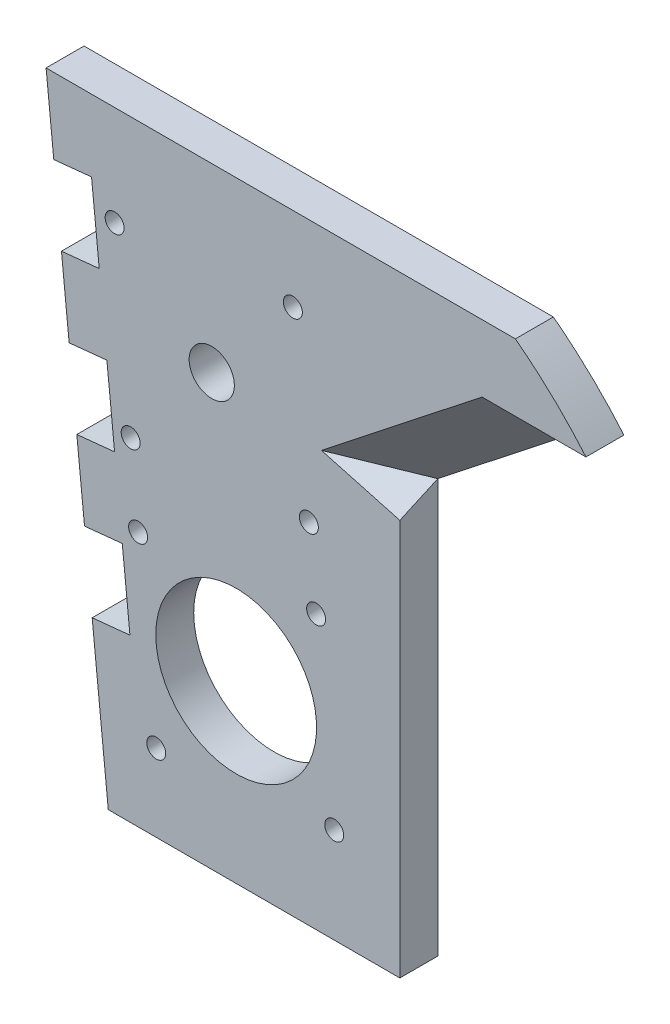
ISO-10303-21;
HEADER;
FILE_DESCRIPTION(('STEP AP214'),'2;1');
FILE_NAME('part.step','',(''),(''),'','','');
FILE_SCHEMA(('AUTOMOTIVE_DESIGN { 1 0 10303 214 1 1 1 1 }'));
ENDSEC;
DATA;
#1=APPLICATION_CONTEXT('core data for automotive mechanical design processes');
#2=APPLICATION_PROTOCOL_DEFINITION('international standard','automotive_design',2000,#1);
#3=PRODUCT_CONTEXT('',#1,'mechanical');
#4=PRODUCT('Part','Part','',(#3));
#5=PRODUCT_RELATED_PRODUCT_CATEGORY('part','',(#4));
#6=PRODUCT_DEFINITION_FORMATION('','',#4);
#7=PRODUCT_DEFINITION_CONTEXT('part definition',#1,'design');
#8=PRODUCT_DEFINITION('design','',#6,#7);
#9=PRODUCT_DEFINITION_SHAPE('','',#8);
#10=(LENGTH_UNIT() NAMED_UNIT(*) SI_UNIT(.MILLI.,.METRE.));
#11=(NAMED_UNIT(*) PLANE_ANGLE_UNIT() SI_UNIT($,.RADIAN.));
#12=(NAMED_UNIT(*) SI_UNIT($,.STERADIAN.) SOLID_ANGLE_UNIT());
#13=UNCERTAINTY_MEASURE_WITH_UNIT(LENGTH_MEASURE(1.E-05),#10,'distance_accuracy_value','');
#14=(GEOMETRIC_REPRESENTATION_CONTEXT(3) GLOBAL_UNCERTAINTY_ASSIGNED_CONTEXT((#13)) GLOBAL_UNIT_ASSIGNED_CONTEXT((#10,
#11,#12)) REPRESENTATION_CONTEXT('',''));
#15=CARTESIAN_POINT('',(0.,0.,0.));
#16=DIRECTION('',(0.,0.,1.));
#17=DIRECTION('',(1.,0.,0.));
#18=AXIS2_PLACEMENT_3D('',#15,#16,#17);
#19=CARTESIAN_POINT('',(89.7774288877045,39.3405764106255,10.));
#20=DIRECTION('',(0.,0.,1.));
#21=DIRECTION('',(1.,0.,0.));
#22=AXIS2_PLACEMENT_3D('',#19,#20,#21);
#23=PLANE('',#22);
#24=DIRECTION('',(0.,-1.,0.));
#25=VECTOR('',#24,1.);
#26=CARTESIAN_POINT('',(49.5550568212858,-113.389032165571,10.));
#27=LINE('',#26,#25);
#28=CARTESIAN_POINT('',(49.5550568212858,-8.97283052752317,10.));
#29=VERTEX_POINT('',#28);
#30=CARTESIAN_POINT('',(49.5550568212858,-113.389032165571,10.));
#31=VERTEX_POINT('',#30);
#32=EDGE_CURVE('E330',#29,#31,#27,.T.);
#33=ORIENTED_EDGE('',*,*,#32,.F.);
#34=DIRECTION('',(-0.964661368461398,0.263492778265711,0.));
#35=VECTOR('',#34,1.);
#36=CARTESIAN_POINT('',(74.7044873939802,-15.8422808341828,10.));
#37=LINE('',#36,#35);
#38=CARTESIAN_POINT('',(28.9020099924533,-3.33154658426689,10.));
#39=VERTEX_POINT('',#38);
#40=EDGE_CURVE('E342',#29,#39,#37,.T.);
#41=ORIENTED_EDGE('',*,*,#40,.T.);
#42=DIRECTION('',(-0.785571964278925,-0.618770303859963,0.));
#43=VECTOR('',#42,1.);
#44=CARTESIAN_POINT('',(87.2120827186889,42.5974619083256,10.));
#45=LINE('',#44,#43);
#46=CARTESIAN_POINT('',(71.2187281014448,30.0000000000001,10.));
#47=VERTEX_POINT('',#46);
#48=EDGE_CURVE('E346',#47,#39,#45,.T.);
#49=ORIENTED_EDGE('',*,*,#48,.F.);
#50=DIRECTION('',(1.,9.70602938485664E-11,0.));
#51=VECTOR('',#50,1.);
#52=CARTESIAN_POINT('',(95.,30.0000000023081,10.));
#53=LINE('',#52,#51);
#54=CARTESIAN_POINT('',(98.5875030935121,30.0000000026563,10.));
#55=VERTEX_POINT('',#54);
#56=EDGE_CURVE('E189',#47,#55,#53,.T.);
#57=ORIENTED_EDGE('',*,*,#56,.T.);
#58=CARTESIAN_POINT('',(98.5875030935121,30.0000000026563,10.));
#59=CARTESIAN_POINT('',(90.261106228653,39.8511854761597,10.));
#60=CARTESIAN_POINT('',(80.,47.6599346875264,10.));
#61=B_SPLINE_CURVE_WITH_KNOTS('',2,(#58,#59,#60),.UNSPECIFIED.,.F.,.F.,(3,3),(0.,1.),.UNSPECIFIED.);
#62=CARTESIAN_POINT('',(80.,47.6599346875264,10.));
#63=VERTEX_POINT('',#62);
#64=EDGE_CURVE('E52',#55,#63,#61,.T.);
#65=ORIENTED_EDGE('',*,*,#64,.T.);
#66=DIRECTION('',(-1.,0.,0.));
#67=VECTOR('',#66,1.);
#68=CARTESIAN_POINT('',(-43.6414188470975,47.6599346875264,10.));
#69=LINE('',#68,#67);
#70=CARTESIAN_POINT('',(-43.6414188470975,47.6599346875264,10.));
#71=VERTEX_POINT('',#70);
#72=EDGE_CURVE('E413',#63,#71,#69,.T.);
#73=ORIENTED_EDGE('',*,*,#72,.T.);
#74=DIRECTION('',(0.101184281533411,-0.99486770033536,0.));
#75=VECTOR('',#74,1.);
#76=CARTESIAN_POINT('',(-43.6414188470975,47.6599346875264,10.));
#77=LINE('',#76,#75);
#78=CARTESIAN_POINT('',(-41.6177332164293,27.7625806808193,10.));
#79=VERTEX_POINT('',#78);
#80=EDGE_CURVE('E121',#71,#79,#77,.T.);
#81=ORIENTED_EDGE('',*,*,#80,.T.);
#82=DIRECTION('',(0.99486770033536,0.101184281533411,0.));
#83=VECTOR('',#82,1.);
#84=CARTESIAN_POINT('',(-41.6177332164293,27.7625806808193,10.));
#85=LINE('',#84,#83);
#86=CARTESIAN_POINT('',(-31.6690562130757,28.7744234961534,10.));
#87=VERTEX_POINT('',#86);
#88=EDGE_CURVE('E416',#79,#87,#85,.T.);
#89=ORIENTED_EDGE('',*,*,#88,.T.);
#90=DIRECTION('',(0.101184281533411,-0.99486770033536,0.));
#91=VECTOR('',#90,1.);
#92=CARTESIAN_POINT('',(-31.6690562130757,28.7744234961534,10.));
#93=LINE('',#92,#91);
#94=CARTESIAN_POINT('',(-29.6453705824075,8.87706948944615,10.));
#95=VERTEX_POINT('',#94);
#96=EDGE_CURVE('E418',#87,#95,#93,.T.);
#97=ORIENTED_EDGE('',*,*,#96,.T.);
#98=DIRECTION('',(-0.99486770033536,-0.10118428153341,0.));
#99=VECTOR('',#98,1.);
#100=CARTESIAN_POINT('',(-29.6453705824075,8.87706948944615,10.));
#101=LINE('',#100,#99);
#102=CARTESIAN_POINT('',(-39.5940475857611,7.86522667411205,10.));
#103=VERTEX_POINT('',#102);
#104=EDGE_CURVE('E420',#95,#103,#101,.T.);
#105=ORIENTED_EDGE('',*,*,#104,.T.);
#106=DIRECTION('',(0.101184281533411,-0.99486770033536,0.));
#107=VECTOR('',#106,1.);
#108=CARTESIAN_POINT('',(-39.5940475857611,7.86522667411205,10.));
#109=LINE('',#108,#107);
#110=CARTESIAN_POINT('',(-37.5703619550929,-12.0321273325951,10.));
#111=VERTEX_POINT('',#110);
#112=EDGE_CURVE('E422',#103,#111,#109,.T.);
#113=ORIENTED_EDGE('',*,*,#112,.T.);
#114=DIRECTION('',(0.99486770033536,0.10118428153341,0.));
#115=VECTOR('',#114,1.);
#116=CARTESIAN_POINT('',(-37.5703619550929,-12.0321273325951,10.));
#117=LINE('',#116,#115);
#118=CARTESIAN_POINT('',(-27.6216849517393,-11.020284517261,10.));
#119=VERTEX_POINT('',#118);
#120=EDGE_CURVE('E424',#111,#119,#117,.T.);
#121=ORIENTED_EDGE('',*,*,#120,.T.);
#122=DIRECTION('',(0.101184281533411,-0.99486770033536,0.));
#123=VECTOR('',#122,1.);
#124=CARTESIAN_POINT('',(-27.6216849517393,-11.020284517261,10.));
#125=LINE('',#124,#123);
#126=CARTESIAN_POINT('',(-25.597999321071,-30.9176385239682,10.));
#127=VERTEX_POINT('',#126);
#128=EDGE_CURVE('E426',#119,#127,#125,.T.);
#129=ORIENTED_EDGE('',*,*,#128,.T.);
#130=DIRECTION('',(-0.99486770033536,-0.101184281533413,0.));
#131=VECTOR('',#130,1.);
#132=CARTESIAN_POINT('',(-25.597999321071,-30.9176385239682,10.));
#133=LINE('',#132,#131);
#134=CARTESIAN_POINT('',(-35.5466763244246,-31.9294813393023,10.));
#135=VERTEX_POINT('',#134);
#136=EDGE_CURVE('E428',#127,#135,#133,.T.);
#137=ORIENTED_EDGE('',*,*,#136,.T.);
#138=DIRECTION('',(0.101184281533411,-0.99486770033536,0.));
#139=VECTOR('',#138,1.);
#140=CARTESIAN_POINT('',(-35.5466763244246,-31.9294813393023,10.));
#141=LINE('',#140,#139);
#142=CARTESIAN_POINT('',(-33.5229906937564,-51.8268353460095,10.));
#143=VERTEX_POINT('',#142);
#144=EDGE_CURVE('E430',#135,#143,#141,.T.);
#145=ORIENTED_EDGE('',*,*,#144,.T.);
#146=DIRECTION('',(0.99486770033536,0.10118428153341,0.));
#147=VECTOR('',#146,1.);
#148=CARTESIAN_POINT('',(-33.5229906937564,-51.8268353460095,10.));
#149=LINE('',#148,#147);
#150=CARTESIAN_POINT('',(-23.5743136904028,-50.8149925306754,10.));
#151=VERTEX_POINT('',#150);
#152=EDGE_CURVE('E432',#143,#151,#149,.T.);
#153=ORIENTED_EDGE('',*,*,#152,.T.);
#154=DIRECTION('',(0.101184281533411,-0.99486770033536,0.));
#155=VECTOR('',#154,1.);
#156=CARTESIAN_POINT('',(-23.5743136904028,-50.8149925306754,10.));
#157=LINE('',#156,#155);
#158=CARTESIAN_POINT('',(-21.5506280597346,-70.7123465373826,10.));
#159=VERTEX_POINT('',#158);
#160=EDGE_CURVE('E434',#151,#159,#157,.T.);
#161=ORIENTED_EDGE('',*,*,#160,.T.);
#162=DIRECTION('',(-0.99486770033536,-0.101184281533412,0.));
#163=VECTOR('',#162,1.);
#164=CARTESIAN_POINT('',(-21.5506280597346,-70.7123465373826,10.));
#165=LINE('',#164,#163);
#166=CARTESIAN_POINT('',(-31.4993050630882,-71.7241893527168,10.));
#167=VERTEX_POINT('',#166);
#168=EDGE_CURVE('E169',#159,#167,#165,.T.);
#169=ORIENTED_EDGE('',*,*,#168,.T.);
#170=DIRECTION('',(0.10118428153341,-0.99486770033536,0.));
#171=VECTOR('',#170,1.);
#172=CARTESIAN_POINT('',(-31.4993050630882,-71.7241893527168,10.));
#173=LINE('',#172,#171);
#174=CARTESIAN_POINT('',(-27.2617293695563,-113.389032165571,10.));
#175=VERTEX_POINT('',#174);
#176=EDGE_CURVE('E161',#167,#175,#173,.T.);
#177=ORIENTED_EDGE('',*,*,#176,.T.);
#178=DIRECTION('',(1.,0.,0.));
#179=VECTOR('',#178,1.);
#180=CARTESIAN_POINT('',(-27.2617293695563,-113.389032165571,10.));
#181=LINE('',#180,#179);
#182=EDGE_CURVE('E167',#175,#31,#181,.T.);
#183=ORIENTED_EDGE('',*,*,#182,.T.);
#184=EDGE_LOOP('',(#33,#41,#49,#57,#65,#73,#81,#89,#97,#105,#113,#121,#129,#137,#145,#153,#161,
#169,#177,#183));
#185=FACE_BOUND('',#184,.T.);
#186=CARTESIAN_POINT('',(-21.3650245311093,-25.5856507985452,10.));
#187=DIRECTION('',(0.,0.,-1.));
#188=DIRECTION('',(1.,0.,0.));
#189=AXIS2_PLACEMENT_3D('',#186,#187,#188);
#190=CIRCLE('',#189,2.50000000000001);
#191=CARTESIAN_POINT('',(-18.8650245311093,-25.5856507985452,10.));
#192=VERTEX_POINT('',#191);
#193=EDGE_CURVE('E354',#192,#192,#190,.T.);
#194=ORIENTED_EDGE('',*,*,#193,.T.);
#195=EDGE_LOOP('',(#194));
#196=FACE_BOUND('',#195,.T.);
#197=CARTESIAN_POINT('',(25.5856507985453,-21.3650245311093,10.));
#198=DIRECTION('',(0.,0.,-1.));
#199=DIRECTION('',(1.,0.,0.));
#200=AXIS2_PLACEMENT_3D('',#197,#198,#199);
#201=CIRCLE('',#200,2.5);
#202=CARTESIAN_POINT('',(28.0856507985453,-21.3650245311093,10.));
#203=VERTEX_POINT('',#202);
#204=EDGE_CURVE('E360',#203,#203,#201,.T.);
#205=ORIENTED_EDGE('',*,*,#204,.T.);
#206=EDGE_LOOP('',(#205));
#207=FACE_BOUND('',#206,.T.);
#208=CARTESIAN_POINT('',(21.3650245311093,25.5856507985452,10.));
#209=DIRECTION('',(0.,0.,-1.));
#210=DIRECTION('',(1.,0.,0.));
#211=AXIS2_PLACEMENT_3D('',#208,#209,#210);
#212=CIRCLE('',#211,2.5);
#213=CARTESIAN_POINT('',(23.8650245311093,25.5856507985452,10.));
#214=VERTEX_POINT('',#213);
#215=EDGE_CURVE('E366',#214,#214,#212,.T.);
#216=ORIENTED_EDGE('',*,*,#215,.T.);
#217=EDGE_LOOP('',(#216));
#218=FACE_BOUND('',#217,.T.);
#219=CARTESIAN_POINT('',(-25.5856507985452,21.3650245311093,10.));
#220=DIRECTION('',(0.,0.,-1.));
#221=DIRECTION('',(1.,0.,0.));
#222=AXIS2_PLACEMENT_3D('',#219,#220,#221);
#223=CIRCLE('',#222,2.49999999999999);
#224=CARTESIAN_POINT('',(-23.0856507985452,21.3650245311093,10.));
#225=VERTEX_POINT('',#224);
#226=EDGE_CURVE('E372',#225,#225,#223,.T.);
#227=ORIENTED_EDGE('',*,*,#226,.T.);
#228=EDGE_LOOP('',(#227));
#229=FACE_BOUND('',#228,.T.);
#230=CARTESIAN_POINT('',(27.5009657487236,-41.3584426999135,10.));
#231=DIRECTION('',(0.,0.,-1.));
#232=DIRECTION('',(-1.,0.,0.));
#233=AXIS2_PLACEMENT_3D('',#230,#231,#232);
#234=CIRCLE('',#233,2.5);
#235=CARTESIAN_POINT('',(25.0009657487236,-41.3584426999135,10.));
#236=VERTEX_POINT('',#235);
#237=EDGE_CURVE('E378',#236,#236,#234,.T.);
#238=ORIENTED_EDGE('',*,*,#237,.T.);
#239=EDGE_LOOP('',(#238));
#240=FACE_BOUND('',#239,.T.);
#241=CARTESIAN_POINT('',(-19.3970976450852,-46.1282697313985,10.));
#242=DIRECTION('',(0.,0.,-1.));
#243=DIRECTION('',(-1.,0.,0.));
#244=AXIS2_PLACEMENT_3D('',#241,#242,#243);
#245=CIRCLE('',#244,2.5);
#246=CARTESIAN_POINT('',(-21.8970976450853,-46.1282697313985,10.));
#247=VERTEX_POINT('',#246);
#248=EDGE_CURVE('E384',#247,#247,#245,.T.);
#249=ORIENTED_EDGE('',*,*,#248,.T.);
#250=EDGE_LOOP('',(#249));
#251=FACE_BOUND('',#250,.T.);
#252=CARTESIAN_POINT('',(32.2707927802086,-88.2565060937223,10.));
#253=DIRECTION('',(0.,0.,-1.));
#254=DIRECTION('',(-1.,0.,0.));
#255=AXIS2_PLACEMENT_3D('',#252,#253,#254);
#256=CIRCLE('',#255,2.5);
#257=CARTESIAN_POINT('',(29.7707927802086,-88.2565060937223,10.));
#258=VERTEX_POINT('',#257);
#259=EDGE_CURVE('E390',#258,#258,#256,.T.);
#260=ORIENTED_EDGE('',*,*,#259,.T.);
#261=EDGE_LOOP('',(#260));
#262=FACE_BOUND('',#261,.T.);
#263=CARTESIAN_POINT('',(-14.6272706136002,-93.0263331252074,10.));
#264=DIRECTION('',(0.,0.,-1.));
#265=DIRECTION('',(-1.,0.,0.));
#266=AXIS2_PLACEMENT_3D('',#263,#264,#265);
#267=CIRCLE('',#266,2.49999999999999);
#268=CARTESIAN_POINT('',(-17.1272706136002,-93.0263331252074,10.));
#269=VERTEX_POINT('',#268);
#270=EDGE_CURVE('E396',#269,#269,#267,.T.);
#271=ORIENTED_EDGE('',*,*,#270,.T.);
#272=EDGE_LOOP('',(#271));
#273=FACE_BOUND('',#272,.T.);
#274=CARTESIAN_POINT('',(6.43684756756168,-67.1923879125604,10.));
#275=DIRECTION('',(0.,0.,-1.));
#276=DIRECTION('',(-1.,0.,0.));
#277=AXIS2_PLACEMENT_3D('',#274,#275,#276);
#278=CIRCLE('',#277,21.1868213887288);
#279=CARTESIAN_POINT('',(-14.7499738211672,-67.1923879125604,10.));
#280=VERTEX_POINT('',#279);
#281=EDGE_CURVE('E402',#280,#280,#278,.T.);
#282=ORIENTED_EDGE('',*,*,#281,.T.);
#283=EDGE_LOOP('',(#282));
#284=FACE_BOUND('',#283,.T.);
#285=CARTESIAN_POINT('',(0.,0.,10.));
#286=DIRECTION('',(0.,0.,1.));
#287=DIRECTION('',(1.,0.,0.));
#288=AXIS2_PLACEMENT_3D('',#285,#286,#287);
#289=CIRCLE('',#288,5.95852080608697);
#290=CARTESIAN_POINT('',(5.95852080608697,0.,10.));
#291=VERTEX_POINT('',#290);
#292=EDGE_CURVE('E408',#291,#291,#289,.T.);
#293=ORIENTED_EDGE('',*,*,#292,.F.);
#294=EDGE_LOOP('',(#293));
#295=FACE_BOUND('',#294,.T.);
#296=ADVANCED_FACE('F35',(#185,#196,#207,#218,#229,#240,#251,#262,#273,#284,#295),#23,.T.);
#297=CARTESIAN_POINT('',(89.7774288877045,39.3405764106255,0.));
#298=DIRECTION('',(0.,0.,1.));
#299=DIRECTION('',(1.,0.,0.));
#300=AXIS2_PLACEMENT_3D('',#297,#298,#299);
#301=PLANE('',#300);
#302=CARTESIAN_POINT('',(-21.3650245311093,-25.5856507985452,0.));
#303=DIRECTION('',(0.,0.,-1.));
#304=DIRECTION('',(1.,0.,0.));
#305=AXIS2_PLACEMENT_3D('',#302,#303,#304);
#306=CIRCLE('',#305,2.50000000000001);
#307=CARTESIAN_POINT('',(-18.8650245311093,-25.5856507985452,0.));
#308=VERTEX_POINT('',#307);
#309=EDGE_CURVE('E348',#308,#308,#306,.T.);
#310=ORIENTED_EDGE('',*,*,#309,.F.);
#311=EDGE_LOOP('',(#310));
#312=FACE_BOUND('',#311,.T.);
#313=CARTESIAN_POINT('',(25.5856507985453,-21.3650245311093,0.));
#314=DIRECTION('',(0.,0.,-1.));
#315=DIRECTION('',(1.,0.,0.));
#316=AXIS2_PLACEMENT_3D('',#313,#314,#315);
#317=CIRCLE('',#316,2.5);
#318=CARTESIAN_POINT('',(28.0856507985453,-21.3650245311093,0.));
#319=VERTEX_POINT('',#318);
#320=EDGE_CURVE('E357',#319,#319,#317,.T.);
#321=ORIENTED_EDGE('',*,*,#320,.F.);
#322=EDGE_LOOP('',(#321));
#323=FACE_BOUND('',#322,.T.);
#324=CARTESIAN_POINT('',(21.3650245311093,25.5856507985452,0.));
#325=DIRECTION('',(0.,0.,-1.));
#326=DIRECTION('',(1.,0.,0.));
#327=AXIS2_PLACEMENT_3D('',#324,#325,#326);
#328=CIRCLE('',#327,2.5);
#329=CARTESIAN_POINT('',(23.8650245311093,25.5856507985452,0.));
#330=VERTEX_POINT('',#329);
#331=EDGE_CURVE('E363',#330,#330,#328,.T.);
#332=ORIENTED_EDGE('',*,*,#331,.F.);
#333=EDGE_LOOP('',(#332));
#334=FACE_BOUND('',#333,.T.);
#335=CARTESIAN_POINT('',(-25.5856507985452,21.3650245311093,0.));
#336=DIRECTION('',(0.,0.,-1.));
#337=DIRECTION('',(1.,0.,0.));
#338=AXIS2_PLACEMENT_3D('',#335,#336,#337);
#339=CIRCLE('',#338,2.49999999999999);
#340=CARTESIAN_POINT('',(-23.0856507985452,21.3650245311093,0.));
#341=VERTEX_POINT('',#340);
#342=EDGE_CURVE('E369',#341,#341,#339,.T.);
#343=ORIENTED_EDGE('',*,*,#342,.F.);
#344=EDGE_LOOP('',(#343));
#345=FACE_BOUND('',#344,.T.);
#346=CARTESIAN_POINT('',(27.5009657487236,-41.3584426999135,0.));
#347=DIRECTION('',(0.,0.,-1.));
#348=DIRECTION('',(-1.,0.,0.));
#349=AXIS2_PLACEMENT_3D('',#346,#347,#348);
#350=CIRCLE('',#349,2.5);
#351=CARTESIAN_POINT('',(25.0009657487236,-41.3584426999135,0.));
#352=VERTEX_POINT('',#351);
#353=EDGE_CURVE('E375',#352,#352,#350,.T.);
#354=ORIENTED_EDGE('',*,*,#353,.F.);
#355=EDGE_LOOP('',(#354));
#356=FACE_BOUND('',#355,.T.);
#357=CARTESIAN_POINT('',(-19.3970976450852,-46.1282697313985,0.));
#358=DIRECTION('',(0.,0.,-1.));
#359=DIRECTION('',(-1.,0.,0.));
#360=AXIS2_PLACEMENT_3D('',#357,#358,#359);
#361=CIRCLE('',#360,2.5);
#362=CARTESIAN_POINT('',(-21.8970976450853,-46.1282697313985,0.));
#363=VERTEX_POINT('',#362);
#364=EDGE_CURVE('E381',#363,#363,#361,.T.);
#365=ORIENTED_EDGE('',*,*,#364,.F.);
#366=EDGE_LOOP('',(#365));
#367=FACE_BOUND('',#366,.T.);
#368=CARTESIAN_POINT('',(32.2707927802086,-88.2565060937223,0.));
#369=DIRECTION('',(0.,0.,-1.));
#370=DIRECTION('',(-1.,0.,0.));
#371=AXIS2_PLACEMENT_3D('',#368,#369,#370);
#372=CIRCLE('',#371,2.5);
#373=CARTESIAN_POINT('',(29.7707927802086,-88.2565060937223,0.));
#374=VERTEX_POINT('',#373);
#375=EDGE_CURVE('E387',#374,#374,#372,.T.);
#376=ORIENTED_EDGE('',*,*,#375,.F.);
#377=EDGE_LOOP('',(#376));
#378=FACE_BOUND('',#377,.T.);
#379=CARTESIAN_POINT('',(-14.6272706136002,-93.0263331252074,0.));
#380=DIRECTION('',(0.,0.,-1.));
#381=DIRECTION('',(-1.,0.,0.));
#382=AXIS2_PLACEMENT_3D('',#379,#380,#381);
#383=CIRCLE('',#382,2.49999999999999);
#384=CARTESIAN_POINT('',(-17.1272706136002,-93.0263331252074,0.));
#385=VERTEX_POINT('',#384);
#386=EDGE_CURVE('E393',#385,#385,#383,.T.);
#387=ORIENTED_EDGE('',*,*,#386,.F.);
#388=EDGE_LOOP('',(#387));
#389=FACE_BOUND('',#388,.T.);
#390=CARTESIAN_POINT('',(6.43684756756168,-67.1923879125604,0.));
#391=DIRECTION('',(0.,0.,-1.));
#392=DIRECTION('',(-1.,0.,0.));
#393=AXIS2_PLACEMENT_3D('',#390,#391,#392);
#394=CIRCLE('',#393,21.1868213887288);
#395=CARTESIAN_POINT('',(-14.7499738211672,-67.1923879125604,0.));
#396=VERTEX_POINT('',#395);
#397=EDGE_CURVE('E399',#396,#396,#394,.T.);
#398=ORIENTED_EDGE('',*,*,#397,.F.);
#399=EDGE_LOOP('',(#398));
#400=FACE_BOUND('',#399,.T.);
#401=CARTESIAN_POINT('',(0.,0.,0.));
#402=DIRECTION('',(0.,0.,1.));
#403=DIRECTION('',(1.,0.,0.));
#404=AXIS2_PLACEMENT_3D('',#401,#402,#403);
#405=CIRCLE('',#404,5.95852080608697);
#406=CARTESIAN_POINT('',(5.95852080608697,0.,0.));
#407=VERTEX_POINT('',#406);
#408=EDGE_CURVE('E405',#407,#407,#405,.T.);
#409=ORIENTED_EDGE('',*,*,#408,.T.);
#410=EDGE_LOOP('',(#409));
#411=FACE_BOUND('',#410,.T.);
#412=DIRECTION('',(-0.785571964278925,-0.618770303859963,0.));
#413=VECTOR('',#412,1.);
#414=CARTESIAN_POINT('',(95.6689711951573,31.8608534274335,0.));
#415=LINE('',#414,#413);
#416=CARTESIAN_POINT('',(93.3064882564435,30.0000000021437,-5.27355936696949E-13));
#417=VERTEX_POINT('',#416);
#418=CARTESIAN_POINT('',(49.5550568212858,-4.46162510638734,0.));
#419=VERTEX_POINT('',#418);
#420=EDGE_CURVE('E44',#417,#419,#415,.T.);
#421=ORIENTED_EDGE('',*,*,#420,.T.);
#422=DIRECTION('',(0.,-1.,0.));
#423=VECTOR('',#422,1.);
#424=CARTESIAN_POINT('',(49.5550568212858,39.3405764106255,0.));
#425=LINE('',#424,#423);
#426=CARTESIAN_POINT('',(49.5550568212858,-113.389032165571,0.));
#427=VERTEX_POINT('',#426);
#428=EDGE_CURVE('E333',#419,#427,#425,.T.);
#429=ORIENTED_EDGE('',*,*,#428,.T.);
#430=DIRECTION('',(1.,0.,0.));
#431=VECTOR('',#430,1.);
#432=CARTESIAN_POINT('',(-27.2617293695563,-113.389032165571,0.));
#433=LINE('',#432,#431);
#434=CARTESIAN_POINT('',(-27.2617293695563,-113.389032165571,0.));
#435=VERTEX_POINT('',#434);
#436=EDGE_CURVE('E536',#435,#427,#433,.T.);
#437=ORIENTED_EDGE('',*,*,#436,.F.);
#438=DIRECTION('',(0.10118428153341,-0.99486770033536,0.));
#439=VECTOR('',#438,1.);
#440=CARTESIAN_POINT('',(-31.4993050630882,-71.7241893527168,0.));
#441=LINE('',#440,#439);
#442=CARTESIAN_POINT('',(-31.4993050630882,-71.7241893527168,0.));
#443=VERTEX_POINT('',#442);
#444=EDGE_CURVE('E178',#443,#435,#441,.T.);
#445=ORIENTED_EDGE('',*,*,#444,.F.);
#446=DIRECTION('',(-0.99486770033536,-0.101184281533412,0.));
#447=VECTOR('',#446,1.);
#448=CARTESIAN_POINT('',(-21.5506280597346,-70.7123465373826,0.));
#449=LINE('',#448,#447);
#450=CARTESIAN_POINT('',(-21.5506280597346,-70.7123465373826,0.));
#451=VERTEX_POINT('',#450);
#452=EDGE_CURVE('E447',#451,#443,#449,.T.);
#453=ORIENTED_EDGE('',*,*,#452,.F.);
#454=DIRECTION('',(0.101184281533411,-0.99486770033536,0.));
#455=VECTOR('',#454,1.);
#456=CARTESIAN_POINT('',(-23.5743136904028,-50.8149925306754,0.));
#457=LINE('',#456,#455);
#458=CARTESIAN_POINT('',(-23.5743136904028,-50.8149925306754,0.));
#459=VERTEX_POINT('',#458);
#460=EDGE_CURVE('E443',#459,#451,#457,.T.);
#461=ORIENTED_EDGE('',*,*,#460,.F.);
#462=DIRECTION('',(0.99486770033536,0.10118428153341,0.));
#463=VECTOR('',#462,1.);
#464=CARTESIAN_POINT('',(-33.5229906937564,-51.8268353460095,0.));
#465=LINE('',#464,#463);
#466=CARTESIAN_POINT('',(-33.5229906937564,-51.8268353460095,0.));
#467=VERTEX_POINT('',#466);
#468=EDGE_CURVE('E529',#467,#459,#465,.T.);
#469=ORIENTED_EDGE('',*,*,#468,.F.);
#470=DIRECTION('',(0.101184281533411,-0.99486770033536,0.));
#471=VECTOR('',#470,1.);
#472=CARTESIAN_POINT('',(-35.5466763244246,-31.9294813393023,0.));
#473=LINE('',#472,#471);
#474=CARTESIAN_POINT('',(-35.5466763244246,-31.9294813393023,0.));
#475=VERTEX_POINT('',#474);
#476=EDGE_CURVE('E527',#475,#467,#473,.T.);
#477=ORIENTED_EDGE('',*,*,#476,.F.);
#478=DIRECTION('',(-0.99486770033536,-0.101184281533413,0.));
#479=VECTOR('',#478,1.);
#480=CARTESIAN_POINT('',(-25.597999321071,-30.9176385239682,0.));
#481=LINE('',#480,#479);
#482=CARTESIAN_POINT('',(-25.597999321071,-30.9176385239682,0.));
#483=VERTEX_POINT('',#482);
#484=EDGE_CURVE('E524',#483,#475,#481,.T.);
#485=ORIENTED_EDGE('',*,*,#484,.F.);
#486=DIRECTION('',(0.101184281533411,-0.99486770033536,0.));
#487=VECTOR('',#486,1.);
#488=CARTESIAN_POINT('',(-27.6216849517393,-11.020284517261,0.));
#489=LINE('',#488,#487);
#490=CARTESIAN_POINT('',(-27.6216849517393,-11.020284517261,0.));
#491=VERTEX_POINT('',#490);
#492=EDGE_CURVE('E521',#491,#483,#489,.T.);
#493=ORIENTED_EDGE('',*,*,#492,.F.);
#494=DIRECTION('',(0.99486770033536,0.10118428153341,0.));
#495=VECTOR('',#494,1.);
#496=CARTESIAN_POINT('',(-37.5703619550929,-12.0321273325951,0.));
#497=LINE('',#496,#495);
#498=CARTESIAN_POINT('',(-37.5703619550929,-12.0321273325951,0.));
#499=VERTEX_POINT('',#498);
#500=EDGE_CURVE('E547',#499,#491,#497,.T.);
#501=ORIENTED_EDGE('',*,*,#500,.F.);
#502=DIRECTION('',(0.101184281533411,-0.99486770033536,0.));
#503=VECTOR('',#502,1.);
#504=CARTESIAN_POINT('',(-39.5940475857611,7.86522667411205,0.));
#505=LINE('',#504,#503);
#506=CARTESIAN_POINT('',(-39.5940475857611,7.86522667411205,0.));
#507=VERTEX_POINT('',#506);
#508=EDGE_CURVE('E513',#507,#499,#505,.T.);
#509=ORIENTED_EDGE('',*,*,#508,.F.);
#510=DIRECTION('',(-0.99486770033536,-0.10118428153341,0.));
#511=VECTOR('',#510,1.);
#512=CARTESIAN_POINT('',(-29.6453705824075,8.87706948944615,0.));
#513=LINE('',#512,#511);
#514=CARTESIAN_POINT('',(-29.6453705824075,8.87706948944615,0.));
#515=VERTEX_POINT('',#514);
#516=EDGE_CURVE('E510',#515,#507,#513,.T.);
#517=ORIENTED_EDGE('',*,*,#516,.F.);
#518=DIRECTION('',(0.101184281533411,-0.99486770033536,0.));
#519=VECTOR('',#518,1.);
#520=CARTESIAN_POINT('',(-31.6690562130757,28.7744234961534,0.));
#521=LINE('',#520,#519);
#522=CARTESIAN_POINT('',(-31.6690562130757,28.7744234961534,0.));
#523=VERTEX_POINT('',#522);
#524=EDGE_CURVE('E551',#523,#515,#521,.T.);
#525=ORIENTED_EDGE('',*,*,#524,.F.);
#526=DIRECTION('',(0.99486770033536,0.101184281533411,0.));
#527=VECTOR('',#526,1.);
#528=CARTESIAN_POINT('',(-41.6177332164293,27.7625806808193,0.));
#529=LINE('',#528,#527);
#530=CARTESIAN_POINT('',(-41.6177332164293,27.7625806808193,0.));
#531=VERTEX_POINT('',#530);
#532=EDGE_CURVE('E502',#531,#523,#529,.T.);
#533=ORIENTED_EDGE('',*,*,#532,.F.);
#534=DIRECTION('',(0.101184281533411,-0.99486770033536,0.));
#535=VECTOR('',#534,1.);
#536=CARTESIAN_POINT('',(-43.6414188470975,47.6599346875264,0.));
#537=LINE('',#536,#535);
#538=CARTESIAN_POINT('',(-43.6414188470975,47.6599346875264,0.));
#539=VERTEX_POINT('',#538);
#540=EDGE_CURVE('E499',#539,#531,#537,.T.);
#541=ORIENTED_EDGE('',*,*,#540,.F.);
#542=DIRECTION('',(-1.,0.,0.));
#543=VECTOR('',#542,1.);
#544=CARTESIAN_POINT('',(-43.6414188470975,47.6599346875264,0.));
#545=LINE('',#544,#543);
#546=CARTESIAN_POINT('',(80.,47.6599346875264,0.));
#547=VERTEX_POINT('',#546);
#548=EDGE_CURVE('E199',#547,#539,#545,.T.);
#549=ORIENTED_EDGE('',*,*,#548,.F.);
#550=CARTESIAN_POINT('',(98.5875030935121,30.0000000026563,0.));
#551=CARTESIAN_POINT('',(90.261106228653,39.8511854761597,0.));
#552=CARTESIAN_POINT('',(80.,47.6599346875264,0.));
#553=B_SPLINE_CURVE_WITH_KNOTS('',2,(#550,#551,#552),.UNSPECIFIED.,.F.,.F.,(3,3),(0.,1.),.UNSPECIFIED.);
#554=CARTESIAN_POINT('',(98.5875030935121,30.0000000026563,0.));
#555=VERTEX_POINT('',#554);
#556=EDGE_CURVE('E112',#555,#547,#553,.T.);
#557=ORIENTED_EDGE('',*,*,#556,.F.);
#558=DIRECTION('',(1.,9.70602938485664E-11,0.));
#559=VECTOR('',#558,1.);
#560=CARTESIAN_POINT('',(95.,30.0000000023081,0.));
#561=LINE('',#560,#559);
#562=EDGE_CURVE('E106',#417,#555,#561,.T.);
#563=ORIENTED_EDGE('',*,*,#562,.F.);
#564=EDGE_LOOP('',(#421,#429,#437,#445,#453,#461,#469,#477,#485,#493,#501,#509,#517,#525,#533,
#541,#549,#557,#563));
#565=FACE_BOUND('',#564,.T.);
#566=ADVANCED_FACE('F211',(#312,#323,#334,#345,#356,#367,#378,#389,#400,#411,#565),#301,.F.);
#567=CARTESIAN_POINT('',(-43.6414188470975,47.6599346875264,10.));
#568=DIRECTION('',(0.,-1.,0.));
#569=DIRECTION('',(0.,0.,-1.));
#570=AXIS2_PLACEMENT_3D('',#567,#568,#569);
#571=PLANE('',#570);
#572=ORIENTED_EDGE('',*,*,#548,.T.);
#573=DIRECTION('',(0.,0.,-1.));
#574=VECTOR('',#573,1.);
#575=CARTESIAN_POINT('',(-43.6414188470975,47.6599346875264,10.));
#576=LINE('',#575,#574);
#577=EDGE_CURVE('E479',#71,#539,#576,.T.);
#578=ORIENTED_EDGE('',*,*,#577,.F.);
#579=ORIENTED_EDGE('',*,*,#72,.F.);
#580=DIRECTION('',(0.,0.,-1.));
#581=VECTOR('',#580,1.);
#582=CARTESIAN_POINT('',(80.,47.6599346875264,10.));
#583=LINE('',#582,#581);
#584=EDGE_CURVE('E198',#63,#547,#583,.T.);
#585=ORIENTED_EDGE('',*,*,#584,.T.);
#586=EDGE_LOOP('',(#572,#578,#579,#585));
#587=FACE_BOUND('',#586,.T.);
#588=ADVANCED_FACE('F37',(#587),#571,.F.);
#589=CARTESIAN_POINT('',(-43.6414188470975,47.6599346875264,10.));
#590=DIRECTION('',(0.99486770033536,0.101184281533411,0.));
#591=DIRECTION('',(-0.101184281533411,0.99486770033536,0.));
#592=AXIS2_PLACEMENT_3D('',#589,#590,#591);
#593=PLANE('',#592);
#594=ORIENTED_EDGE('',*,*,#540,.T.);
#595=DIRECTION('',(0.,0.,-1.));
#596=VECTOR('',#595,1.);
#597=CARTESIAN_POINT('',(-41.6177332164293,27.7625806808193,10.));
#598=LINE('',#597,#596);
#599=EDGE_CURVE('E476',#79,#531,#598,.T.);
#600=ORIENTED_EDGE('',*,*,#599,.F.);
#601=ORIENTED_EDGE('',*,*,#80,.F.);
#602=ORIENTED_EDGE('',*,*,#577,.T.);
#603=EDGE_LOOP('',(#594,#600,#601,#602));
#604=FACE_BOUND('',#603,.T.);
#605=ADVANCED_FACE('F261',(#604),#593,.F.);
#606=CARTESIAN_POINT('',(-41.6177332164293,27.7625806808193,10.));
#607=DIRECTION('',(-0.101184281533411,0.99486770033536,0.));
#608=DIRECTION('',(-0.99486770033536,-0.101184281533411,0.));
#609=AXIS2_PLACEMENT_3D('',#606,#607,#608);
#610=PLANE('',#609);
#611=ORIENTED_EDGE('',*,*,#532,.T.);
#612=DIRECTION('',(0.,0.,-1.));
#613=VECTOR('',#612,1.);
#614=CARTESIAN_POINT('',(-31.6690562130757,28.7744234961534,10.));
#615=LINE('',#614,#613);
#616=EDGE_CURVE('E473',#87,#523,#615,.T.);
#617=ORIENTED_EDGE('',*,*,#616,.F.);
#618=ORIENTED_EDGE('',*,*,#88,.F.);
#619=ORIENTED_EDGE('',*,*,#599,.T.);
#620=EDGE_LOOP('',(#611,#617,#618,#619));
#621=FACE_BOUND('',#620,.T.);
#622=ADVANCED_FACE('F258',(#621),#610,.F.);
#623=CARTESIAN_POINT('',(-31.6690562130757,28.7744234961534,10.));
#624=DIRECTION('',(0.99486770033536,0.101184281533411,0.));
#625=DIRECTION('',(-0.101184281533411,0.99486770033536,0.));
#626=AXIS2_PLACEMENT_3D('',#623,#624,#625);
#627=PLANE('',#626);
#628=ORIENTED_EDGE('',*,*,#524,.T.);
#629=DIRECTION('',(0.,0.,-1.));
#630=VECTOR('',#629,1.);
#631=CARTESIAN_POINT('',(-29.6453705824075,8.87706948944615,10.));
#632=LINE('',#631,#630);
#633=EDGE_CURVE('E470',#95,#515,#632,.T.);
#634=ORIENTED_EDGE('',*,*,#633,.F.);
#635=ORIENTED_EDGE('',*,*,#96,.F.);
#636=ORIENTED_EDGE('',*,*,#616,.T.);
#637=EDGE_LOOP('',(#628,#634,#635,#636));
#638=FACE_BOUND('',#637,.T.);
#639=ADVANCED_FACE('F254',(#638),#627,.F.);
#640=CARTESIAN_POINT('',(-29.6453705824075,8.87706948944615,10.));
#641=DIRECTION('',(0.10118428153341,-0.99486770033536,0.));
#642=DIRECTION('',(0.99486770033536,0.10118428153341,0.));
#643=AXIS2_PLACEMENT_3D('',#640,#641,#642);
#644=PLANE('',#643);
#645=ORIENTED_EDGE('',*,*,#516,.T.);
#646=DIRECTION('',(0.,0.,-1.));
#647=VECTOR('',#646,1.);
#648=CARTESIAN_POINT('',(-39.5940475857611,7.86522667411205,10.));
#649=LINE('',#648,#647);
#650=EDGE_CURVE('E467',#103,#507,#649,.T.);
#651=ORIENTED_EDGE('',*,*,#650,.F.);
#652=ORIENTED_EDGE('',*,*,#104,.F.);
#653=ORIENTED_EDGE('',*,*,#633,.T.);
#654=EDGE_LOOP('',(#645,#651,#652,#653));
#655=FACE_BOUND('',#654,.T.);
#656=ADVANCED_FACE('F250',(#655),#644,.F.);
#657=CARTESIAN_POINT('',(-39.5940475857611,7.86522667411205,10.));
#658=DIRECTION('',(0.99486770033536,0.101184281533411,0.));
#659=DIRECTION('',(-0.101184281533411,0.99486770033536,0.));
#660=AXIS2_PLACEMENT_3D('',#657,#658,#659);
#661=PLANE('',#660);
#662=ORIENTED_EDGE('',*,*,#508,.T.);
#663=DIRECTION('',(0.,0.,-1.));
#664=VECTOR('',#663,1.);
#665=CARTESIAN_POINT('',(-37.5703619550929,-12.0321273325951,10.));
#666=LINE('',#665,#664);
#667=EDGE_CURVE('E464',#111,#499,#666,.T.);
#668=ORIENTED_EDGE('',*,*,#667,.F.);
#669=ORIENTED_EDGE('',*,*,#112,.F.);
#670=ORIENTED_EDGE('',*,*,#650,.T.);
#671=EDGE_LOOP('',(#662,#668,#669,#670));
#672=FACE_BOUND('',#671,.T.);
#673=ADVANCED_FACE('F246',(#672),#661,.F.);
#674=CARTESIAN_POINT('',(-37.5703619550929,-12.0321273325951,10.));
#675=DIRECTION('',(-0.10118428153341,0.99486770033536,0.));
#676=DIRECTION('',(-0.99486770033536,-0.10118428153341,0.));
#677=AXIS2_PLACEMENT_3D('',#674,#675,#676);
#678=PLANE('',#677);
#679=ORIENTED_EDGE('',*,*,#500,.T.);
#680=DIRECTION('',(0.,0.,-1.));
#681=VECTOR('',#680,1.);
#682=CARTESIAN_POINT('',(-27.6216849517393,-11.020284517261,10.));
#683=LINE('',#682,#681);
#684=EDGE_CURVE('E461',#119,#491,#683,.T.);
#685=ORIENTED_EDGE('',*,*,#684,.F.);
#686=ORIENTED_EDGE('',*,*,#120,.F.);
#687=ORIENTED_EDGE('',*,*,#667,.T.);
#688=EDGE_LOOP('',(#679,#685,#686,#687));
#689=FACE_BOUND('',#688,.T.);
#690=ADVANCED_FACE('F242',(#689),#678,.F.);
#691=CARTESIAN_POINT('',(-27.6216849517393,-11.020284517261,10.));
#692=DIRECTION('',(0.99486770033536,0.101184281533411,0.));
#693=DIRECTION('',(-0.101184281533411,0.99486770033536,0.));
#694=AXIS2_PLACEMENT_3D('',#691,#692,#693);
#695=PLANE('',#694);
#696=ORIENTED_EDGE('',*,*,#492,.T.);
#697=DIRECTION('',(0.,0.,-1.));
#698=VECTOR('',#697,1.);
#699=CARTESIAN_POINT('',(-25.597999321071,-30.9176385239682,10.));
#700=LINE('',#699,#698);
#701=EDGE_CURVE('E458',#127,#483,#700,.T.);
#702=ORIENTED_EDGE('',*,*,#701,.F.);
#703=ORIENTED_EDGE('',*,*,#128,.F.);
#704=ORIENTED_EDGE('',*,*,#684,.T.);
#705=EDGE_LOOP('',(#696,#702,#703,#704));
#706=FACE_BOUND('',#705,.T.);
#707=ADVANCED_FACE('F238',(#706),#695,.F.);
#708=CARTESIAN_POINT('',(-25.597999321071,-30.9176385239682,10.));
#709=DIRECTION('',(0.101184281533413,-0.99486770033536,0.));
#710=DIRECTION('',(0.99486770033536,0.101184281533413,0.));
#711=AXIS2_PLACEMENT_3D('',#708,#709,#710);
#712=PLANE('',#711);
#713=ORIENTED_EDGE('',*,*,#484,.T.);
#714=DIRECTION('',(0.,0.,-1.));
#715=VECTOR('',#714,1.);
#716=CARTESIAN_POINT('',(-35.5466763244246,-31.9294813393023,10.));
#717=LINE('',#716,#715);
#718=EDGE_CURVE('E455',#135,#475,#717,.T.);
#719=ORIENTED_EDGE('',*,*,#718,.F.);
#720=ORIENTED_EDGE('',*,*,#136,.F.);
#721=ORIENTED_EDGE('',*,*,#701,.T.);
#722=EDGE_LOOP('',(#713,#719,#720,#721));
#723=FACE_BOUND('',#722,.T.);
#724=ADVANCED_FACE('F234',(#723),#712,.F.);
#725=CARTESIAN_POINT('',(-35.5466763244246,-31.9294813393023,10.));
#726=DIRECTION('',(0.99486770033536,0.101184281533411,0.));
#727=DIRECTION('',(-0.101184281533411,0.99486770033536,0.));
#728=AXIS2_PLACEMENT_3D('',#725,#726,#727);
#729=PLANE('',#728);
#730=ORIENTED_EDGE('',*,*,#476,.T.);
#731=DIRECTION('',(0.,0.,-1.));
#732=VECTOR('',#731,1.);
#733=CARTESIAN_POINT('',(-33.5229906937564,-51.8268353460095,10.));
#734=LINE('',#733,#732);
#735=EDGE_CURVE('E452',#143,#467,#734,.T.);
#736=ORIENTED_EDGE('',*,*,#735,.F.);
#737=ORIENTED_EDGE('',*,*,#144,.F.);
#738=ORIENTED_EDGE('',*,*,#718,.T.);
#739=EDGE_LOOP('',(#730,#736,#737,#738));
#740=FACE_BOUND('',#739,.T.);
#741=ADVANCED_FACE('F230',(#740),#729,.F.);
#742=CARTESIAN_POINT('',(-33.5229906937564,-51.8268353460095,10.));
#743=DIRECTION('',(-0.10118428153341,0.99486770033536,0.));
#744=DIRECTION('',(-0.99486770033536,-0.10118428153341,0.));
#745=AXIS2_PLACEMENT_3D('',#742,#743,#744);
#746=PLANE('',#745);
#747=ORIENTED_EDGE('',*,*,#468,.T.);
#748=DIRECTION('',(0.,0.,-1.));
#749=VECTOR('',#748,1.);
#750=CARTESIAN_POINT('',(-23.5743136904028,-50.8149925306754,10.));
#751=LINE('',#750,#749);
#752=EDGE_CURVE('E445',#151,#459,#751,.T.);
#753=ORIENTED_EDGE('',*,*,#752,.F.);
#754=ORIENTED_EDGE('',*,*,#152,.F.);
#755=ORIENTED_EDGE('',*,*,#735,.T.);
#756=EDGE_LOOP('',(#747,#753,#754,#755));
#757=FACE_BOUND('',#756,.T.);
#758=ADVANCED_FACE('F226',(#757),#746,.F.);
#759=CARTESIAN_POINT('',(-23.5743136904028,-50.8149925306754,10.));
#760=DIRECTION('',(0.99486770033536,0.101184281533411,0.));
#761=DIRECTION('',(-0.101184281533411,0.99486770033536,0.));
#762=AXIS2_PLACEMENT_3D('',#759,#760,#761);
#763=PLANE('',#762);
#764=ORIENTED_EDGE('',*,*,#460,.T.);
#765=DIRECTION('',(0.,0.,-1.));
#766=VECTOR('',#765,1.);
#767=CARTESIAN_POINT('',(-21.5506280597346,-70.7123465373826,10.));
#768=LINE('',#767,#766);
#769=EDGE_CURVE('E441',#159,#451,#768,.T.);
#770=ORIENTED_EDGE('',*,*,#769,.F.);
#771=ORIENTED_EDGE('',*,*,#160,.F.);
#772=ORIENTED_EDGE('',*,*,#752,.T.);
#773=EDGE_LOOP('',(#764,#770,#771,#772));
#774=FACE_BOUND('',#773,.T.);
#775=ADVANCED_FACE('F222',(#774),#763,.F.);
#776=CARTESIAN_POINT('',(-21.5506280597346,-70.7123465373826,10.));
#777=DIRECTION('',(0.101184281533412,-0.99486770033536,0.));
#778=DIRECTION('',(0.99486770033536,0.101184281533412,0.));
#779=AXIS2_PLACEMENT_3D('',#776,#777,#778);
#780=PLANE('',#779);
#781=ORIENTED_EDGE('',*,*,#452,.T.);
#782=DIRECTION('',(0.,0.,-1.));
#783=VECTOR('',#782,1.);
#784=CARTESIAN_POINT('',(-31.4993050630882,-71.7241893527168,10.));
#785=LINE('',#784,#783);
#786=EDGE_CURVE('E182',#167,#443,#785,.T.);
#787=ORIENTED_EDGE('',*,*,#786,.F.);
#788=ORIENTED_EDGE('',*,*,#168,.F.);
#789=ORIENTED_EDGE('',*,*,#769,.T.);
#790=EDGE_LOOP('',(#781,#787,#788,#789));
#791=FACE_BOUND('',#790,.T.);
#792=ADVANCED_FACE('F219',(#791),#780,.F.);
#793=CARTESIAN_POINT('',(-31.4993050630882,-71.7241893527168,10.));
#794=DIRECTION('',(0.99486770033536,0.10118428153341,0.));
#795=DIRECTION('',(-0.10118428153341,0.99486770033536,0.));
#796=AXIS2_PLACEMENT_3D('',#793,#794,#795);
#797=PLANE('',#796);
#798=ORIENTED_EDGE('',*,*,#444,.T.);
#799=DIRECTION('',(0.,0.,-1.));
#800=VECTOR('',#799,1.);
#801=CARTESIAN_POINT('',(-27.2617293695563,-113.389032165571,10.));
#802=LINE('',#801,#800);
#803=EDGE_CURVE('E175',#175,#435,#802,.T.);
#804=ORIENTED_EDGE('',*,*,#803,.F.);
#805=ORIENTED_EDGE('',*,*,#176,.F.);
#806=ORIENTED_EDGE('',*,*,#786,.T.);
#807=EDGE_LOOP('',(#798,#804,#805,#806));
#808=FACE_BOUND('',#807,.T.);
#809=ADVANCED_FACE('F176',(#808),#797,.F.);
#810=CARTESIAN_POINT('',(-27.2617293695563,-113.389032165571,10.));
#811=DIRECTION('',(0.,1.,0.));
#812=DIRECTION('',(-1.,0.,0.));
#813=AXIS2_PLACEMENT_3D('',#810,#811,#812);
#814=PLANE('',#813);
#815=ORIENTED_EDGE('',*,*,#436,.T.);
#816=DIRECTION('',(0.,0.,1.));
#817=VECTOR('',#816,1.);
#818=CARTESIAN_POINT('',(49.5550568212858,-113.389032165571,-14.));
#819=LINE('',#818,#817);
#820=EDGE_CURVE('E188',#427,#31,#819,.T.);
#821=ORIENTED_EDGE('',*,*,#820,.T.);
#822=ORIENTED_EDGE('',*,*,#182,.F.);
#823=ORIENTED_EDGE('',*,*,#803,.T.);
#824=EDGE_LOOP('',(#815,#821,#822,#823));
#825=FACE_BOUND('',#824,.T.);
#826=ADVANCED_FACE('F186',(#825),#814,.F.);
#827=CARTESIAN_POINT('',(95.,30.0000000023081,10.));
#828=DIRECTION('',(-9.70602938485664E-11,1.,0.));
#829=DIRECTION('',(-1.,-9.70602938485664E-11,0.));
#830=AXIS2_PLACEMENT_3D('',#827,#828,#829);
#831=PLANE('',#830);
#832=ORIENTED_EDGE('',*,*,#562,.T.);
#833=DIRECTION('',(0.,0.,-1.));
#834=VECTOR('',#833,1.);
#835=CARTESIAN_POINT('',(98.5875030935121,30.0000000026563,10.));
#836=LINE('',#835,#834);
#837=EDGE_CURVE('E183',#55,#555,#836,.T.);
#838=ORIENTED_EDGE('',*,*,#837,.F.);
#839=ORIENTED_EDGE('',*,*,#56,.F.);
#840=DIRECTION('',(-0.910985245796095,1.90506749757598E-10,0.412438943289584));
#841=VECTOR('',#840,1.);
#842=CARTESIAN_POINT('',(108.68806392121,29.9999999921644,-6.96384583897575));
#843=LINE('',#842,#841);
#844=EDGE_CURVE('E350',#417,#47,#843,.T.);
#845=ORIENTED_EDGE('',*,*,#844,.F.);
#846=EDGE_LOOP('',(#832,#838,#839,#845));
#847=FACE_BOUND('',#846,.T.);
#848=ADVANCED_FACE('F210',(#847),#831,.F.);
#849=DIRECTION('',(0.,0.,-1.));
#850=VECTOR('',#849,1.);
#851=SURFACE_OF_LINEAR_EXTRUSION('',#61,#850);
#852=ORIENTED_EDGE('',*,*,#556,.T.);
#853=ORIENTED_EDGE('',*,*,#584,.F.);
#854=ORIENTED_EDGE('',*,*,#64,.F.);
#855=ORIENTED_EDGE('',*,*,#837,.T.);
#856=EDGE_LOOP('',(#852,#853,#854,#855));
#857=FACE_BOUND('',#856,.T.);
#858=ADVANCED_FACE('F205',(#857),#851,.F.);
#859=CARTESIAN_POINT('',(0.,0.,10.));
#860=DIRECTION('',(0.,0.,-1.));
#861=DIRECTION('',(-1.,0.,0.));
#862=AXIS2_PLACEMENT_3D('',#859,#860,#861);
#863=CYLINDRICAL_SURFACE('',#862,5.95852080608697);
#864=ORIENTED_EDGE('',*,*,#292,.T.);
#865=EDGE_LOOP('',(#864));
#866=FACE_BOUND('',#865,.T.);
#867=ORIENTED_EDGE('',*,*,#408,.F.);
#868=EDGE_LOOP('',(#867));
#869=FACE_BOUND('',#868,.T.);
#870=ADVANCED_FACE('F209',(#866,#869),#863,.F.);
#871=CARTESIAN_POINT('',(6.43684756756168,-67.1923879125604,10.));
#872=DIRECTION('',(0.,0.,-1.));
#873=DIRECTION('',(-1.,0.,0.));
#874=AXIS2_PLACEMENT_3D('',#871,#872,#873);
#875=CYLINDRICAL_SURFACE('',#874,21.1868213887288);
#876=ORIENTED_EDGE('',*,*,#281,.F.);
#877=EDGE_LOOP('',(#876));
#878=FACE_BOUND('',#877,.T.);
#879=ORIENTED_EDGE('',*,*,#397,.T.);
#880=EDGE_LOOP('',(#879));
#881=FACE_BOUND('',#880,.T.);
#882=ADVANCED_FACE('F276',(#878,#881),#875,.F.);
#883=CARTESIAN_POINT('',(-14.6272706136002,-93.0263331252074,10.));
#884=DIRECTION('',(0.,0.,-1.));
#885=DIRECTION('',(-1.,0.,0.));
#886=AXIS2_PLACEMENT_3D('',#883,#884,#885);
#887=CYLINDRICAL_SURFACE('',#886,2.49999999999999);
#888=ORIENTED_EDGE('',*,*,#270,.F.);
#889=EDGE_LOOP('',(#888));
#890=FACE_BOUND('',#889,.T.);
#891=ORIENTED_EDGE('',*,*,#386,.T.);
#892=EDGE_LOOP('',(#891));
#893=FACE_BOUND('',#892,.T.);
#894=ADVANCED_FACE('F280',(#890,#893),#887,.F.);
#895=CARTESIAN_POINT('',(32.2707927802086,-88.2565060937223,10.));
#896=DIRECTION('',(0.,0.,-1.));
#897=DIRECTION('',(-1.,0.,0.));
#898=AXIS2_PLACEMENT_3D('',#895,#896,#897);
#899=CYLINDRICAL_SURFACE('',#898,2.5);
#900=ORIENTED_EDGE('',*,*,#259,.F.);
#901=EDGE_LOOP('',(#900));
#902=FACE_BOUND('',#901,.T.);
#903=ORIENTED_EDGE('',*,*,#375,.T.);
#904=EDGE_LOOP('',(#903));
#905=FACE_BOUND('',#904,.T.);
#906=ADVANCED_FACE('F284',(#902,#905),#899,.F.);
#907=CARTESIAN_POINT('',(-19.3970976450852,-46.1282697313985,10.));
#908=DIRECTION('',(0.,0.,-1.));
#909=DIRECTION('',(-1.,0.,0.));
#910=AXIS2_PLACEMENT_3D('',#907,#908,#909);
#911=CYLINDRICAL_SURFACE('',#910,2.5);
#912=ORIENTED_EDGE('',*,*,#248,.F.);
#913=EDGE_LOOP('',(#912));
#914=FACE_BOUND('',#913,.T.);
#915=ORIENTED_EDGE('',*,*,#364,.T.);
#916=EDGE_LOOP('',(#915));
#917=FACE_BOUND('',#916,.T.);
#918=ADVANCED_FACE('F288',(#914,#917),#911,.F.);
#919=CARTESIAN_POINT('',(27.5009657487236,-41.3584426999135,10.));
#920=DIRECTION('',(0.,0.,-1.));
#921=DIRECTION('',(-1.,0.,0.));
#922=AXIS2_PLACEMENT_3D('',#919,#920,#921);
#923=CYLINDRICAL_SURFACE('',#922,2.5);
#924=ORIENTED_EDGE('',*,*,#237,.F.);
#925=EDGE_LOOP('',(#924));
#926=FACE_BOUND('',#925,.T.);
#927=ORIENTED_EDGE('',*,*,#353,.T.);
#928=EDGE_LOOP('',(#927));
#929=FACE_BOUND('',#928,.T.);
#930=ADVANCED_FACE('F292',(#926,#929),#923,.F.);
#931=CARTESIAN_POINT('',(-25.5856507985452,21.3650245311093,10.));
#932=DIRECTION('',(0.,0.,-1.));
#933=DIRECTION('',(-1.,0.,0.));
#934=AXIS2_PLACEMENT_3D('',#931,#932,#933);
#935=CYLINDRICAL_SURFACE('',#934,2.49999999999999);
#936=ORIENTED_EDGE('',*,*,#226,.F.);
#937=EDGE_LOOP('',(#936));
#938=FACE_BOUND('',#937,.T.);
#939=ORIENTED_EDGE('',*,*,#342,.T.);
#940=EDGE_LOOP('',(#939));
#941=FACE_BOUND('',#940,.T.);
#942=ADVANCED_FACE('F296',(#938,#941),#935,.F.);
#943=CARTESIAN_POINT('',(21.3650245311093,25.5856507985452,10.));
#944=DIRECTION('',(0.,0.,-1.));
#945=DIRECTION('',(-1.,0.,0.));
#946=AXIS2_PLACEMENT_3D('',#943,#944,#945);
#947=CYLINDRICAL_SURFACE('',#946,2.5);
#948=ORIENTED_EDGE('',*,*,#215,.F.);
#949=EDGE_LOOP('',(#948));
#950=FACE_BOUND('',#949,.T.);
#951=ORIENTED_EDGE('',*,*,#331,.T.);
#952=EDGE_LOOP('',(#951));
#953=FACE_BOUND('',#952,.T.);
#954=ADVANCED_FACE('F300',(#950,#953),#947,.F.);
#955=CARTESIAN_POINT('',(25.5856507985453,-21.3650245311093,10.));
#956=DIRECTION('',(0.,0.,-1.));
#957=DIRECTION('',(-1.,0.,0.));
#958=AXIS2_PLACEMENT_3D('',#955,#956,#957);
#959=CYLINDRICAL_SURFACE('',#958,2.5);
#960=ORIENTED_EDGE('',*,*,#204,.F.);
#961=EDGE_LOOP('',(#960));
#962=FACE_BOUND('',#961,.T.);
#963=ORIENTED_EDGE('',*,*,#320,.T.);
#964=EDGE_LOOP('',(#963));
#965=FACE_BOUND('',#964,.T.);
#966=ADVANCED_FACE('F304',(#962,#965),#959,.F.);
#967=CARTESIAN_POINT('',(-21.3650245311093,-25.5856507985452,10.));
#968=DIRECTION('',(0.,0.,-1.));
#969=DIRECTION('',(-1.,0.,0.));
#970=AXIS2_PLACEMENT_3D('',#967,#968,#969);
#971=CYLINDRICAL_SURFACE('',#970,2.50000000000001);
#972=ORIENTED_EDGE('',*,*,#193,.F.);
#973=EDGE_LOOP('',(#972));
#974=FACE_BOUND('',#973,.T.);
#975=ORIENTED_EDGE('',*,*,#309,.T.);
#976=EDGE_LOOP('',(#975));
#977=FACE_BOUND('',#976,.T.);
#978=ADVANCED_FACE('F308',(#974,#977),#971,.F.);
#979=CARTESIAN_POINT('',(7.37192602007478,-9.35917313417112,16.2829333855027));
#980=DIRECTION('',(-0.365379890120896,0.463875199245583,-0.807042338059233));
#981=DIRECTION('',(0.,0.866987134178819,0.498330522011645));
#982=AXIS2_PLACEMENT_3D('',#979,#980,#981);
#983=PLANE('',#982);
#984=ORIENTED_EDGE('',*,*,#48,.T.);
#985=DIRECTION('',(0.898957124061715,-0.049188487617773,-0.435266104566582));
#986=VECTOR('',#985,1.);
#987=CARTESIAN_POINT('',(98.5428702371977,-7.14210495257067,-23.7194123568842));
#988=LINE('',#987,#986);
#989=EDGE_CURVE('E345',#39,#419,#988,.T.);
#990=ORIENTED_EDGE('',*,*,#989,.T.);
#991=ORIENTED_EDGE('',*,*,#420,.F.);
#992=ORIENTED_EDGE('',*,*,#844,.T.);
#993=EDGE_LOOP('',(#984,#990,#991,#992));
#994=FACE_BOUND('',#993,.T.);
#995=ADVANCED_FACE('F312',(#994),#983,.F.);
#996=CARTESIAN_POINT('',(107.311987600099,-18.2751097344647,-4.35039624346255));
#997=DIRECTION('',(0.241606343033317,0.884533940677658,0.399031430836369));
#998=DIRECTION('',(0.,-0.411213911117749,0.911538874268807));
#999=AXIS2_PLACEMENT_3D('',#996,#997,#998);
#1000=PLANE('',#999);
#1001=DIRECTION('',(0.,-0.411213911117749,0.911538874268807));
#1002=VECTOR('',#1001,1.);
#1003=CARTESIAN_POINT('',(49.5550568212858,-5.16675076618837,1.56305376052569));
#1004=LINE('',#1003,#1002);
#1005=EDGE_CURVE('E11',#419,#29,#1004,.T.);
#1006=ORIENTED_EDGE('',*,*,#1005,.F.);
#1007=ORIENTED_EDGE('',*,*,#989,.F.);
#1008=ORIENTED_EDGE('',*,*,#40,.F.);
#1009=EDGE_LOOP('',(#1006,#1007,#1008));
#1010=FACE_BOUND('',#1009,.T.);
#1011=ADVANCED_FACE('F314',(#1010),#1000,.T.);
#1012=CARTESIAN_POINT('',(49.5550568212858,-113.389032165571,-14.));
#1013=DIRECTION('',(-1.,0.,0.));
#1014=DIRECTION('',(0.,0.,1.));
#1015=AXIS2_PLACEMENT_3D('',#1012,#1013,#1014);
#1016=PLANE('',#1015);
#1017=ORIENTED_EDGE('',*,*,#1005,.T.);
#1018=ORIENTED_EDGE('',*,*,#32,.T.);
#1019=ORIENTED_EDGE('',*,*,#820,.F.);
#1020=ORIENTED_EDGE('',*,*,#428,.F.);
#1021=EDGE_LOOP('',(#1017,#1018,#1019,#1020));
#1022=FACE_BOUND('',#1021,.T.);
#1023=ADVANCED_FACE('F317',(#1022),#1016,.F.);
#1024=CLOSED_SHELL('',(#296,#566,#588,#605,#622,#639,#656,#673,#690,#707,#724,#741,#758,#775,
#792,#809,#826,#848,#858,#870,#882,#894,#906,#918,#930,#942,#954,#966,#978,#995,#1011,#1023));
#1025=MANIFOLD_SOLID_BREP('B2',#1024);
#1026=ADVANCED_BREP_SHAPE_REPRESENTATION('',(#18,#1025),#14);
#1027=SHAPE_DEFINITION_REPRESENTATION(#9,#1026);
ENDSEC;
END-ISO-10303-21;
